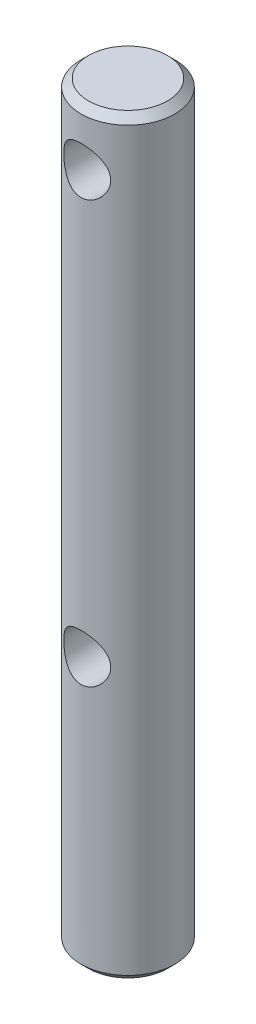
ISO-10303-21;
HEADER;
FILE_DESCRIPTION(('STEP AP214'),'2;1');
FILE_NAME('part.step','',(''),(''),'','','');
FILE_SCHEMA(('AUTOMOTIVE_DESIGN { 1 0 10303 214 1 1 1 1 }'));
ENDSEC;
DATA;
#1=APPLICATION_CONTEXT('core data for automotive mechanical design processes');
#2=APPLICATION_PROTOCOL_DEFINITION('international standard','automotive_design',2000,#1);
#3=PRODUCT_CONTEXT('',#1,'mechanical');
#4=PRODUCT('Part','Part','',(#3));
#5=PRODUCT_RELATED_PRODUCT_CATEGORY('part','',(#4));
#6=PRODUCT_DEFINITION_FORMATION('','',#4);
#7=PRODUCT_DEFINITION_CONTEXT('part definition',#1,'design');
#8=PRODUCT_DEFINITION('design','',#6,#7);
#9=PRODUCT_DEFINITION_SHAPE('','',#8);
#10=(LENGTH_UNIT() NAMED_UNIT(*) SI_UNIT(.MILLI.,.METRE.));
#11=(NAMED_UNIT(*) PLANE_ANGLE_UNIT() SI_UNIT($,.RADIAN.));
#12=(NAMED_UNIT(*) SI_UNIT($,.STERADIAN.) SOLID_ANGLE_UNIT());
#13=UNCERTAINTY_MEASURE_WITH_UNIT(LENGTH_MEASURE(1.E-05),#10,'distance_accuracy_value','');
#14=(GEOMETRIC_REPRESENTATION_CONTEXT(3) GLOBAL_UNCERTAINTY_ASSIGNED_CONTEXT((#13)) GLOBAL_UNIT_ASSIGNED_CONTEXT((#10,
#11,#12)) REPRESENTATION_CONTEXT('',''));
#15=CARTESIAN_POINT('',(0.,0.,0.));
#16=DIRECTION('',(0.,0.,1.));
#17=DIRECTION('',(1.,0.,0.));
#18=AXIS2_PLACEMENT_3D('',#15,#16,#17);
#19=CARTESIAN_POINT('',(0.,50.8,0.));
#20=DIRECTION('',(0.,-1.,0.));
#21=DIRECTION('',(0.,0.,-1.));
#22=AXIS2_PLACEMENT_3D('',#19,#20,#21);
#23=CYLINDRICAL_SURFACE('',#22,3.175);
#24=CARTESIAN_POINT('',(0.,48.5775,-3.175));
#25=CARTESIAN_POINT('',(-0.083457991185083,48.5774947575715,-3.17499545030503));
#26=CARTESIAN_POINT('',(-0.167015477019881,48.5708800089203,-3.17167404493863));
#27=CARTESIAN_POINT('',(-0.331660873489373,48.5447135524578,-3.15871472708987));
#28=CARTESIAN_POINT('',(-0.412743787657887,48.525137276116,-3.1490648192841));
#29=CARTESIAN_POINT('',(-0.569807002497712,48.4740048288211,-3.12445843552858));
#30=CARTESIAN_POINT('',(-0.645805799665895,48.4424952150063,-3.10952259694341));
#31=CARTESIAN_POINT('',(-0.791325279180476,48.3686316385831,-3.07571420218771));
#32=CARTESIAN_POINT('',(-0.860846471709219,48.3262785310049,-3.05684195643221));
#33=CARTESIAN_POINT('',(-0.996168660697032,48.2290163664421,-3.01555559984673));
#34=CARTESIAN_POINT('',(-1.06149014765635,48.1735027142071,-2.99299628614965));
#35=CARTESIAN_POINT('',(-1.18233736872633,48.0527971516953,-2.94735202766705));
#36=CARTESIAN_POINT('',(-1.23785563818199,47.9875979353112,-2.92426669731842));
#37=CARTESIAN_POINT('',(-1.34183755071482,47.8433076826316,-2.87812085025789));
#38=CARTESIAN_POINT('',(-1.38942022018823,47.7635314438759,-2.85520109315084));
#39=CARTESIAN_POINT('',(-1.47029206018898,47.5958418541219,-2.81441491301059));
#40=CARTESIAN_POINT('',(-1.50359144125905,47.5079343706526,-2.79654488326096));
#41=CARTESIAN_POINT('',(-1.55278525197438,47.3318441451427,-2.76951863922521));
#42=CARTESIAN_POINT('',(-1.5696022981152,47.243992932343,-2.75990481139145));
#43=CARTESIAN_POINT('',(-1.58817785187779,47.0662335950251,-2.74926250293288));
#44=CARTESIAN_POINT('',(-1.58995124029225,46.976327591367,-2.7482255383247));
#45=CARTESIAN_POINT('',(-1.57906606838602,46.8085709363994,-2.75448601783382));
#46=CARTESIAN_POINT('',(-1.5681079882647,46.7305643504334,-2.76080162313447));
#47=CARTESIAN_POINT('',(-1.53501701037788,46.5776914688703,-2.77933513114987));
#48=CARTESIAN_POINT('',(-1.51288055293752,46.5028261818278,-2.79155491395445));
#49=CARTESIAN_POINT('',(-1.45765802636278,46.356223752052,-2.82078868805227));
#50=CARTESIAN_POINT('',(-1.42432891904664,46.2846000919276,-2.83790772054098));
#51=CARTESIAN_POINT('',(-1.34785367917295,46.1476180605134,-2.87501654296729));
#52=CARTESIAN_POINT('',(-1.30470313705229,46.0822625222348,-2.89500762088553));
#53=CARTESIAN_POINT('',(-1.20342986217405,45.9509475112701,-2.93867138171466));
#54=CARTESIAN_POINT('',(-1.14410245266123,45.8859622131978,-2.96248947500834));
#55=CARTESIAN_POINT('',(-1.01529448125193,45.7664575229869,-3.00906851989396));
#56=CARTESIAN_POINT('',(-0.945809094811676,45.7119431326462,-3.03182896234596));
#57=CARTESIAN_POINT('',(-0.794569953008056,45.6125490131153,-3.07501904811705));
#58=CARTESIAN_POINT('',(-0.712396326664058,45.5682342499924,-3.09529137357187));
#59=CARTESIAN_POINT('',(-0.540490117088461,45.4944209663942,-3.12988136279972));
#60=CARTESIAN_POINT('',(-0.450763602321123,45.4649106812884,-3.14420375322891));
#61=CARTESIAN_POINT('',(-0.274266805511363,45.4239702965998,-3.16427379814529));
#62=CARTESIAN_POINT('',(-0.187867179745466,45.411245163252,-3.1706333955333));
#63=CARTESIAN_POINT('',(-0.013937614919594,45.400174739324,-3.17615908866327));
#64=CARTESIAN_POINT('',(0.0735917690434815,45.4018226365473,-3.17532859220093));
#65=CARTESIAN_POINT('',(0.240082343027755,45.4187031178648,-3.16692267702328));
#66=CARTESIAN_POINT('',(0.319181810279265,45.4328728957089,-3.15987502529967));
#67=CARTESIAN_POINT('',(0.473720941529333,45.4727279391335,-3.14042696962309));
#68=CARTESIAN_POINT('',(0.549160201034602,45.4984144742449,-3.12802597555879));
#69=CARTESIAN_POINT('',(0.696735665913698,45.5612475654624,-3.09854999119071));
#70=CARTESIAN_POINT('',(0.768715755246715,45.5987007920596,-3.08135149809289));
#71=CARTESIAN_POINT('',(0.905607411697596,45.6836582128389,-3.043935592289));
#72=CARTESIAN_POINT('',(0.970515949770341,45.7311666886702,-3.02371689462514));
#73=CARTESIAN_POINT('',(1.09818120674663,45.8402696752125,-2.97986801371214));
#74=CARTESIAN_POINT('',(1.16010067353771,45.9027893036567,-2.95609779689055));
#75=CARTESIAN_POINT('',(1.27294690977618,46.0373811776534,-2.90929046679002));
#76=CARTESIAN_POINT('',(1.3238660748176,46.1094599761711,-2.88625386997575));
#77=CARTESIAN_POINT('',(1.41558631423544,46.2655343009996,-2.84243767627802));
#78=CARTESIAN_POINT('',(1.45577797458289,46.349937884925,-2.82182140722634));
#79=CARTESIAN_POINT('',(1.52095648617134,46.5256722322753,-2.78723839766939));
#80=CARTESIAN_POINT('',(1.54596292893889,46.6169938982662,-2.77326309427028));
#81=CARTESIAN_POINT('',(1.57775542885366,46.7945949788295,-2.75528882878461));
#82=CARTESIAN_POINT('',(1.58606013179365,46.8805168773284,-2.75046096250791));
#83=CARTESIAN_POINT('',(1.58859403257222,47.0526222191237,-2.74900000493545));
#84=CARTESIAN_POINT('',(1.5828293315144,47.1388055328714,-2.75236336156894));
#85=CARTESIAN_POINT('',(1.55880772437938,47.3003300586843,-2.76602606006084));
#86=CARTESIAN_POINT('',(1.54179319901956,47.3759219963548,-2.7756341249122));
#87=CARTESIAN_POINT('',(1.49729088118125,47.5230953895862,-2.79988988197899));
#88=CARTESIAN_POINT('',(1.46979971971637,47.5946755465711,-2.81453919516849));
#89=CARTESIAN_POINT('',(1.40305749566464,47.7371169509411,-2.84842791953701));
#90=CARTESIAN_POINT('',(1.36314043128242,47.8076067941536,-2.86790959303524));
#91=CARTESIAN_POINT('',(1.27341466747435,47.9413483261878,-2.90886088970341));
#92=CARTESIAN_POINT('',(1.22360082184597,48.0045962222023,-2.93033154400532));
#93=CARTESIAN_POINT('',(1.10839778107492,48.130050396988,-2.97596438013471));
#94=CARTESIAN_POINT('',(1.04185152150814,48.1911963249811,-3.00013660999272));
#95=CARTESIAN_POINT('',(0.898770754895197,48.3016924862035,-3.0460593171264));
#96=CARTESIAN_POINT('',(0.822230898247,48.3510363614085,-3.06780848569085));
#97=CARTESIAN_POINT('',(0.660291409892928,48.4365877258054,-3.10670590186878));
#98=CARTESIAN_POINT('',(0.574832962245561,48.4726998686629,-3.12382053184118));
#99=CARTESIAN_POINT('',(0.398053085556713,48.5295704663149,-3.15120879312142));
#100=CARTESIAN_POINT('',(0.306749131847696,48.5503725568041,-3.1615018583887));
#101=CARTESIAN_POINT('',(0.178755590054295,48.5678121400986,-3.17016545787646));
#102=CARTESIAN_POINT('',(0.143131983613484,48.5714399423753,-3.17197367477648));
#103=CARTESIAN_POINT('',(0.0716783742405832,48.5762850315036,-3.17439193950695));
#104=CARTESIAN_POINT('',(0.0358483656390228,48.5775022518214,-3.17500195426617));
#105=CARTESIAN_POINT('',(0.,48.5775,-3.175));
#106=B_SPLINE_CURVE_WITH_KNOTS('',3,(#24,#25,#26,#27,#28,#29,#30,#31,#32,#33,#34,#35,#36,#37,
#38,#39,#40,#41,#42,#43,#44,#45,#46,#47,#48,#49,#50,#51,#52,#53,#54,#55,#56,#57,#58,#59,#60,#61,
#62,#63,#64,#65,#66,#67,#68,#69,#70,#71,#72,#73,#74,#75,#76,#77,#78,#79,#80,#81,#82,#83,#84,#85,
#86,#87,#88,#89,#90,#91,#92,#93,#94,#95,#96,#97,#98,#99,#100,#101,#102,#103,#104,#105),
.UNSPECIFIED.,.T.,.F.,(4,2,2,2,2,2,2,2,2,2,2,2,2,2,2,2,2,2,2,2,2,2,2,2,2,2,2,2,2,2,2,2,2,2,2,2,
2,2,2,2,4),(0.,0.250228508654714,0.500932687663352,0.750668671844023,1.00038496992324,
1.26520854196497,1.53023290227578,1.8158099070882,2.10118242288521,2.36947094272614,
2.63749404759819,2.87346568449796,3.10951251232015,3.35105756267474,3.59271127500602,
3.86500594367532,4.13743036175415,4.42250547765424,4.70735369348243,4.96860973623261,
5.22974196161968,5.47063464078468,5.71155388089103,5.95936158944289,6.20727503062988,
6.47953381898015,6.75198021926997,7.03762057931739,7.32289162713402,7.58077775661086,
7.83855207535177,8.07176964270058,8.30506226951507,8.55402875138706,8.80312503315514,
9.08248822877009,9.36200158617726,9.64349121690847,9.92417542436073,10.0316550721259,
10.1391376863632),.UNSPECIFIED.);
#107=CARTESIAN_POINT('',(0.,48.5775,-3.175));
#108=VERTEX_POINT('',#107);
#109=EDGE_CURVE('E40',#108,#108,#106,.T.);
#110=ORIENTED_EDGE('',*,*,#109,.T.);
#111=EDGE_LOOP('',(#110));
#112=FACE_BOUND('',#111,.T.);
#113=CARTESIAN_POINT('',(1.5875,46.99,2.74963065701559));
#114=CARTESIAN_POINT('',(1.58749422638082,46.90727885449,2.74963786381429));
#115=CARTESIAN_POINT('',(1.58099120353898,46.824453259204,2.75342034385563));
#116=CARTESIAN_POINT('',(1.55531059571316,46.661344217325,2.76800256742633));
#117=CARTESIAN_POINT('',(1.53610637747976,46.5810664848686,2.77881705563201));
#118=CARTESIAN_POINT('',(1.48605866856095,46.425720482854,2.8058958773607));
#119=CARTESIAN_POINT('',(1.4552770495838,46.3506269891982,2.82213119013788));
#120=CARTESIAN_POINT('',(1.38313719653499,46.2066890793302,2.85817730396762));
#121=CARTESIAN_POINT('',(1.34177839028179,46.1378450014584,2.87798829843252));
#122=CARTESIAN_POINT('',(1.24565813309277,46.002089655915,2.92095029628688));
#123=CARTESIAN_POINT('',(1.19007260737824,45.9358061221183,2.94424201025251));
#124=CARTESIAN_POINT('',(1.06879041958797,45.8130141834043,2.99040522672308));
#125=CARTESIAN_POINT('',(1.00308874467939,45.7565106543987,3.01327651457109));
#126=CARTESIAN_POINT('',(0.858027181920594,45.6511546475531,3.05786594662806));
#127=CARTESIAN_POINT('',(0.778045162557466,45.603074643523,3.07940243938849));
#128=CARTESIAN_POINT('',(0.609849279726715,45.5213388954723,3.11706825308002));
#129=CARTESIAN_POINT('',(0.521640654294323,45.4876740483822,3.1332009850419));
#130=CARTESIAN_POINT('',(0.346146348482491,45.4382113501845,3.15722732225227));
#131=CARTESIAN_POINT('',(0.259241592401001,45.4213126269106,3.16562549850666));
#132=CARTESIAN_POINT('',(0.0834558730578376,45.4022362866034,3.17512039355631));
#133=CARTESIAN_POINT('',(-0.0054238617769311,45.4000497623368,3.17622153020536));
#134=CARTESIAN_POINT('',(-0.1743591325227,45.4100353449279,3.17123733792365));
#135=CARTESIAN_POINT('',(-0.254509903693154,45.4209753496399,3.16576862228805));
#136=CARTESIAN_POINT('',(-0.411660612920334,45.4546983396986,3.14919114349849));
#137=CARTESIAN_POINT('',(-0.488660314736604,45.4774822112498,3.138081958304));
#138=CARTESIAN_POINT('',(-0.638666159116664,45.5343935736676,3.11104888469151));
#139=CARTESIAN_POINT('',(-0.711602309830344,45.5686736471607,3.09506050927604));
#140=CARTESIAN_POINT('',(-0.850863172402407,45.6473931732199,3.05971013003866));
#141=CARTESIAN_POINT('',(-0.917185505031348,45.6918362629925,3.04034691900006));
#142=CARTESIAN_POINT('',(-1.04802568667588,45.7944463705587,2.99790476108776));
#143=CARTESIAN_POINT('',(-1.1117803441091,45.8535135574675,2.97464759397103));
#144=CARTESIAN_POINT('',(-1.22889068784772,45.9812861883266,2.92821265681564));
#145=CARTESIAN_POINT('',(-1.28223837337409,46.0499989784851,2.90503496121686));
#146=CARTESIAN_POINT('',(-1.38033971874451,46.2004540054732,2.85978847796819));
#147=CARTESIAN_POINT('',(-1.42433248752765,46.2827465615986,2.83788357985248));
#148=CARTESIAN_POINT('',(-1.49751909188945,46.4549135532824,2.79996027317239));
#149=CARTESIAN_POINT('',(-1.52672836990979,46.5447799624154,2.78393572698132));
#150=CARTESIAN_POINT('',(-1.56714858500225,46.7220530366614,2.76137109359542));
#151=CARTESIAN_POINT('',(-1.57960238136546,46.8090902764816,2.75418003659488));
#152=CARTESIAN_POINT('',(-1.58990815274564,46.9842871296575,2.74824696986555));
#153=CARTESIAN_POINT('',(-1.5877704422376,47.0724459062277,2.74949899186782));
#154=CARTESIAN_POINT('',(-1.57009471880854,47.2371005957437,2.75962009258178));
#155=CARTESIAN_POINT('',(-1.55604815903104,47.3138173786338,2.76764095166814));
#156=CARTESIAN_POINT('',(-1.517167851854,47.4636588607051,2.78914259212754));
#157=CARTESIAN_POINT('',(-1.49233061106499,47.5367823880602,2.80262514157991));
#158=CARTESIAN_POINT('',(-1.43136554691026,47.681215487808,2.83426252551455));
#159=CARTESIAN_POINT('',(-1.3947680761122,47.752284189255,2.85260483648363));
#160=CARTESIAN_POINT('',(-1.31173071412509,47.8876824685682,2.89172839701884));
#161=CARTESIAN_POINT('',(-1.26528576687739,47.9520085590773,2.91251089701297));
#162=CARTESIAN_POINT('',(-1.15702900292818,48.0805787934436,2.95732197549433));
#163=CARTESIAN_POINT('',(-1.09401811980001,48.1437904767643,2.98142950757434));
#164=CARTESIAN_POINT('',(-0.957904636444784,48.2590669278148,3.02790598027404));
#165=CARTESIAN_POINT('',(-0.884798641015365,48.311127930241,3.05027433199738));
#166=CARTESIAN_POINT('',(-0.727924888062029,48.4037857899458,3.09151911684394));
#167=CARTESIAN_POINT('',(-0.643926667398906,48.4440438251598,3.11028781154346));
#168=CARTESIAN_POINT('',(-0.469141753867718,48.5094564223736,3.1413982599789));
#169=CARTESIAN_POINT('',(-0.37836110096008,48.534624246544,3.15374565586242));
#170=CARTESIAN_POINT('',(-0.201580245699537,48.5669725956273,3.16972169238739));
#171=CARTESIAN_POINT('',(-0.1159056671126,48.5755916279533,3.17404635554254));
#172=CARTESIAN_POINT('',(0.0557625026975351,48.5788386839089,3.17566881970521));
#173=CARTESIAN_POINT('',(0.141755971718449,48.5734716052811,3.17296908056188));
#174=CARTESIAN_POINT('',(0.30565406280347,48.5498514542119,3.16125175530202));
#175=CARTESIAN_POINT('',(0.383718304525382,48.5324708018034,3.15266220285434));
#176=CARTESIAN_POINT('',(0.535695449091493,48.4864933886065,3.13042448690684));
#177=CARTESIAN_POINT('',(0.609607754866869,48.4578950193516,3.11677559798313));
#178=CARTESIAN_POINT('',(0.754734657413753,48.3890208046865,3.08492415062641));
#179=CARTESIAN_POINT('',(0.825698664036324,48.3482978244075,3.06655179803093));
#180=CARTESIAN_POINT('',(0.960079743879765,48.2568917847613,3.02717411362649));
#181=CARTESIAN_POINT('',(1.02349332927116,48.2062041507789,3.00616757411397));
#182=CARTESIAN_POINT('',(1.14762598159906,48.0904595418015,2.96114168734771));
#183=CARTESIAN_POINT('',(1.20744882420609,48.0244745511299,2.93703055931071));
#184=CARTESIAN_POINT('',(1.31550296873904,47.8830469802065,2.89025133408528));
#185=CARTESIAN_POINT('',(1.36372401564097,47.8075961218726,2.86758452646961));
#186=CARTESIAN_POINT('',(1.44848433915973,47.6462143235527,2.82574373421554));
#187=CARTESIAN_POINT('',(1.48460629221299,47.5600275443331,2.80670276631829));
#188=CARTESIAN_POINT('',(1.54126995134143,47.3815848081106,2.77600023171258));
#189=CARTESIAN_POINT('',(1.56186376599086,47.2893502888511,2.76431400634477));
#190=CARTESIAN_POINT('',(1.57855762498476,47.1617589979024,2.75477720255342));
#191=CARTESIAN_POINT('',(1.58190581663011,47.1275284676434,2.75285404795678));
#192=CARTESIAN_POINT('',(1.58637828058031,47.0588713369169,2.75027923221803));
#193=CARTESIAN_POINT('',(1.58750240410979,47.0244447234874,2.74962765613611));
#194=CARTESIAN_POINT('',(1.5875,46.99,2.74963065701559));
#195=B_SPLINE_CURVE_WITH_KNOTS('',3,(#113,#114,#115,#116,#117,#118,#119,#120,#121,#122,#123,
#124,#125,#126,#127,#128,#129,#130,#131,#132,#133,#134,#135,#136,#137,#138,#139,#140,#141,#142,
#143,#144,#145,#146,#147,#148,#149,#150,#151,#152,#153,#154,#155,#156,#157,#158,#159,#160,#161,
#162,#163,#164,#165,#166,#167,#168,#169,#170,#171,#172,#173,#174,#175,#176,#177,#178,#179,#180,
#181,#182,#183,#184,#185,#186,#187,#188,#189,#190,#191,#192,#193,#194),.UNSPECIFIED.,.T.,.F.,(4,
2,2,2,2,2,2,2,2,2,2,2,2,2,2,2,2,2,2,2,2,2,2,2,2,2,2,2,2,2,2,2,2,2,2,2,2,2,2,2,4),(0.,
0.248018494619114,0.496558717359377,0.743789146021224,0.991032951644172,1.25866892109094,
1.52643794096438,1.81225653929037,2.09789437805177,2.36320782386597,2.62836062601588,
2.87045554756704,3.1125685862146,3.35803136385695,3.60358212718556,3.87234416437813,
4.14131201590395,4.42736036245499,4.71310929061081,4.97621386731062,5.23913247936542,
5.4732901618564,5.70752370742249,5.95260583044664,6.19781409374325,6.47393205434223,
6.75014310652895,7.03364387993082,7.31689512946424,7.5741572924331,7.83132937785429,
8.07155524483494,8.3118155695032,8.56235191767161,8.81300355284891,9.08860008936981,
9.36443934266681,9.64899564098785,9.93259273641882,10.0358596460668,10.1391334633508),.UNSPECIFIED.);
#196=CARTESIAN_POINT('',(1.5875,46.99,2.74963065701559));
#197=VERTEX_POINT('',#196);
#198=EDGE_CURVE('E99',#197,#197,#195,.T.);
#199=ORIENTED_EDGE('',*,*,#198,.T.);
#200=EDGE_LOOP('',(#199));
#201=FACE_BOUND('',#200,.T.);
#202=CARTESIAN_POINT('',(0.,20.066,-3.175));
#203=CARTESIAN_POINT('',(-0.0834579911850833,20.0659947575714,-3.17499545030503));
#204=CARTESIAN_POINT('',(-0.167015477019881,20.0593800089203,-3.17167404493863));
#205=CARTESIAN_POINT('',(-0.331660873489373,20.0332135524578,-3.15871472708987));
#206=CARTESIAN_POINT('',(-0.412743787657887,20.013637276116,-3.1490648192841));
#207=CARTESIAN_POINT('',(-0.569807002497711,19.9625048288211,-3.12445843552858));
#208=CARTESIAN_POINT('',(-0.645805799665893,19.9309952150063,-3.10952259694341));
#209=CARTESIAN_POINT('',(-0.791325279180473,19.8571316385831,-3.07571420218771));
#210=CARTESIAN_POINT('',(-0.860846471709217,19.8147785310049,-3.05684195643221));
#211=CARTESIAN_POINT('',(-0.99616866069703,19.7175163664421,-3.01555559984673));
#212=CARTESIAN_POINT('',(-1.06149014765635,19.6620027142071,-2.99299628614965));
#213=CARTESIAN_POINT('',(-1.18233736872633,19.5412971516953,-2.94735202766705));
#214=CARTESIAN_POINT('',(-1.23785563818199,19.4760979353112,-2.92426669731842));
#215=CARTESIAN_POINT('',(-1.34183755071482,19.3318076826316,-2.87812085025789));
#216=CARTESIAN_POINT('',(-1.38942022018822,19.2520314438759,-2.85520109315084));
#217=CARTESIAN_POINT('',(-1.47029206018898,19.0843418541219,-2.81441491301059));
#218=CARTESIAN_POINT('',(-1.50359144125905,18.9964343706526,-2.79654488326096));
#219=CARTESIAN_POINT('',(-1.55278525197438,18.8203441451427,-2.76951863922521));
#220=CARTESIAN_POINT('',(-1.5696022981152,18.732492932343,-2.75990481139145));
#221=CARTESIAN_POINT('',(-1.58817785187779,18.5547335950251,-2.74926250293288));
#222=CARTESIAN_POINT('',(-1.58995124029225,18.464827591367,-2.7482255383247));
#223=CARTESIAN_POINT('',(-1.57906606838602,18.2970709363994,-2.75448601783382));
#224=CARTESIAN_POINT('',(-1.5681079882647,18.2190643504334,-2.76080162313447));
#225=CARTESIAN_POINT('',(-1.53501701037788,18.0661914688703,-2.77933513114987));
#226=CARTESIAN_POINT('',(-1.51288055293752,17.9913261818278,-2.79155491395445));
#227=CARTESIAN_POINT('',(-1.45765802636278,17.844723752052,-2.82078868805226));
#228=CARTESIAN_POINT('',(-1.42432891904664,17.7731000919276,-2.83790772054098));
#229=CARTESIAN_POINT('',(-1.34785367917295,17.6361180605134,-2.87501654296728));
#230=CARTESIAN_POINT('',(-1.30470313705229,17.5707625222349,-2.89500762088552));
#231=CARTESIAN_POINT('',(-1.20342986217405,17.4394475112701,-2.93867138171466));
#232=CARTESIAN_POINT('',(-1.14410245266124,17.3744622131978,-2.96248947500834));
#233=CARTESIAN_POINT('',(-1.01529448125193,17.2549575229869,-3.00906851989396));
#234=CARTESIAN_POINT('',(-0.945809094811678,17.2004431326462,-3.03182896234596));
#235=CARTESIAN_POINT('',(-0.79456995300806,17.1010490131153,-3.07501904811705));
#236=CARTESIAN_POINT('',(-0.712396326664062,17.0567342499924,-3.09529137357186));
#237=CARTESIAN_POINT('',(-0.540490117088466,16.9829209663942,-3.12988136279972));
#238=CARTESIAN_POINT('',(-0.450763602321126,16.9534106812884,-3.14420375322891));
#239=CARTESIAN_POINT('',(-0.274266805511365,16.9124702965998,-3.16427379814529));
#240=CARTESIAN_POINT('',(-0.187867179745468,16.899745163252,-3.1706333955333));
#241=CARTESIAN_POINT('',(-0.0139376149195961,16.888674739324,-3.17615908866327));
#242=CARTESIAN_POINT('',(0.0735917690434799,16.8903226365473,-3.17532859220093));
#243=CARTESIAN_POINT('',(0.240082343027754,16.9072031178648,-3.16692267702328));
#244=CARTESIAN_POINT('',(0.319181810279264,16.9213728957089,-3.15987502529967));
#245=CARTESIAN_POINT('',(0.473720941529331,16.9612279391335,-3.14042696962309));
#246=CARTESIAN_POINT('',(0.5491602010346,16.9869144742449,-3.12802597555879));
#247=CARTESIAN_POINT('',(0.696735665913696,17.0497475654624,-3.09854999119071));
#248=CARTESIAN_POINT('',(0.768715755246711,17.0872007920596,-3.08135149809289));
#249=CARTESIAN_POINT('',(0.905607411697592,17.1721582128389,-3.043935592289));
#250=CARTESIAN_POINT('',(0.970515949770337,17.2196666886702,-3.02371689462515));
#251=CARTESIAN_POINT('',(1.09818120674663,17.3287696752125,-2.97986801371214));
#252=CARTESIAN_POINT('',(1.1601006735377,17.3912893036567,-2.95609779689055));
#253=CARTESIAN_POINT('',(1.27294690977618,17.5258811776534,-2.90929046679002));
#254=CARTESIAN_POINT('',(1.3238660748176,17.5979599761711,-2.88625386997575));
#255=CARTESIAN_POINT('',(1.41558631423544,17.7540343009996,-2.84243767627802));
#256=CARTESIAN_POINT('',(1.45577797458289,17.838437884925,-2.82182140722634));
#257=CARTESIAN_POINT('',(1.52095648617134,18.0141722322753,-2.78723839766939));
#258=CARTESIAN_POINT('',(1.54596292893889,18.1054938982662,-2.77326309427028));
#259=CARTESIAN_POINT('',(1.57775542885366,18.2830949788295,-2.75528882878461));
#260=CARTESIAN_POINT('',(1.58606013179365,18.3690168773284,-2.75046096250791));
#261=CARTESIAN_POINT('',(1.58859403257222,18.5411222191237,-2.74900000493545));
#262=CARTESIAN_POINT('',(1.5828293315144,18.6273055328714,-2.75236336156894));
#263=CARTESIAN_POINT('',(1.55880772437938,18.7888300586843,-2.76602606006084));
#264=CARTESIAN_POINT('',(1.54179319901956,18.8644219963548,-2.7756341249122));
#265=CARTESIAN_POINT('',(1.49729088118125,19.0115953895862,-2.79988988197899));
#266=CARTESIAN_POINT('',(1.46979971971638,19.0831755465711,-2.81453919516849));
#267=CARTESIAN_POINT('',(1.40305749566465,19.2256169509411,-2.848427919537));
#268=CARTESIAN_POINT('',(1.36314043128242,19.2961067941536,-2.86790959303524));
#269=CARTESIAN_POINT('',(1.27341466747436,19.4298483261877,-2.90886088970341));
#270=CARTESIAN_POINT('',(1.22360082184598,19.4930962222023,-2.93033154400532));
#271=CARTESIAN_POINT('',(1.10839778107493,19.618550396988,-2.97596438013471));
#272=CARTESIAN_POINT('',(1.04185152150815,19.6796963249811,-3.00013660999272));
#273=CARTESIAN_POINT('',(0.898770754895199,19.7901924862035,-3.0460593171264));
#274=CARTESIAN_POINT('',(0.822230898247,19.8395363614085,-3.06780848569085));
#275=CARTESIAN_POINT('',(0.660291409892926,19.9250877258054,-3.10670590186878));
#276=CARTESIAN_POINT('',(0.574832962245559,19.9611998686629,-3.12382053184118));
#277=CARTESIAN_POINT('',(0.398053085556712,20.0180704663149,-3.15120879312142));
#278=CARTESIAN_POINT('',(0.306749131847696,20.0388725568041,-3.1615018583887));
#279=CARTESIAN_POINT('',(0.178755590054296,20.0563121400986,-3.17016545787646));
#280=CARTESIAN_POINT('',(0.143131983613485,20.0599399423753,-3.17197367477648));
#281=CARTESIAN_POINT('',(0.0716783742405836,20.0647850315036,-3.17439193950695));
#282=CARTESIAN_POINT('',(0.035848365639023,20.0660022518215,-3.17500195426617));
#283=CARTESIAN_POINT('',(0.,20.066,-3.175));
#284=B_SPLINE_CURVE_WITH_KNOTS('',3,(#202,#203,#204,#205,#206,#207,#208,#209,#210,#211,#212,
#213,#214,#215,#216,#217,#218,#219,#220,#221,#222,#223,#224,#225,#226,#227,#228,#229,#230,#231,
#232,#233,#234,#235,#236,#237,#238,#239,#240,#241,#242,#243,#244,#245,#246,#247,#248,#249,#250,
#251,#252,#253,#254,#255,#256,#257,#258,#259,#260,#261,#262,#263,#264,#265,#266,#267,#268,#269,
#270,#271,#272,#273,#274,#275,#276,#277,#278,#279,#280,#281,#282,#283),.UNSPECIFIED.,.T.,.F.,(4,
2,2,2,2,2,2,2,2,2,2,2,2,2,2,2,2,2,2,2,2,2,2,2,2,2,2,2,2,2,2,2,2,2,2,2,2,2,2,2,4),(0.,
0.250228508654715,0.50093268766335,0.750668671844021,1.00038496992324,1.26520854196497,
1.53023290227578,1.8158099070882,2.10118242288521,2.36947094272614,2.63749404759819,
2.87346568449796,3.10951251232014,3.35105756267473,3.59271127500602,3.86500594367532,
4.13743036175414,4.42250547765424,4.70735369348243,4.96860973623261,5.22974196161968,
5.47063464078468,5.71155388089103,5.95936158944288,6.20727503062988,6.47953381898014,
6.75198021926997,7.03762057931739,7.32289162713403,7.58077775661086,7.83855207535176,
8.07176964270058,8.30506226951507,8.55402875138705,8.80312503315513,9.08248822877009,
9.36200158617727,9.64349121690848,9.92417542436074,10.0316550721259,10.1391376863632),.UNSPECIFIED.);
#285=CARTESIAN_POINT('',(0.,20.066,-3.175));
#286=VERTEX_POINT('',#285);
#287=EDGE_CURVE('E65',#286,#286,#284,.T.);
#288=ORIENTED_EDGE('',*,*,#287,.T.);
#289=EDGE_LOOP('',(#288));
#290=FACE_BOUND('',#289,.T.);
#291=CARTESIAN_POINT('',(1.5875,18.4785,2.74963065701559));
#292=CARTESIAN_POINT('',(1.58749422638082,18.39577885449,2.74963786381429));
#293=CARTESIAN_POINT('',(1.58099120353898,18.312953259204,2.75342034385563));
#294=CARTESIAN_POINT('',(1.55531059571316,18.149844217325,2.76800256742633));
#295=CARTESIAN_POINT('',(1.53610637747976,18.0695664848686,2.77881705563201));
#296=CARTESIAN_POINT('',(1.48605866856095,17.914220482854,2.8058958773607));
#297=CARTESIAN_POINT('',(1.4552770495838,17.8391269891982,2.82213119013788));
#298=CARTESIAN_POINT('',(1.38313719653499,17.6951890793302,2.85817730396762));
#299=CARTESIAN_POINT('',(1.34177839028179,17.6263450014584,2.87798829843253));
#300=CARTESIAN_POINT('',(1.24565813309277,17.490589655915,2.92095029628688));
#301=CARTESIAN_POINT('',(1.19007260737824,17.4243061221182,2.94424201025251));
#302=CARTESIAN_POINT('',(1.06879041958797,17.3015141834043,2.99040522672308));
#303=CARTESIAN_POINT('',(1.00308874467939,17.2450106543987,3.01327651457109));
#304=CARTESIAN_POINT('',(0.858027181920591,17.1396546475531,3.05786594662807));
#305=CARTESIAN_POINT('',(0.778045162557461,17.091574643523,3.07940243938849));
#306=CARTESIAN_POINT('',(0.609849279726712,17.0098388954724,3.11706825308002));
#307=CARTESIAN_POINT('',(0.521640654294321,16.9761740483822,3.1332009850419));
#308=CARTESIAN_POINT('',(0.346146348482488,16.9267113501845,3.15722732225227));
#309=CARTESIAN_POINT('',(0.259241592400997,16.9098126269106,3.16562549850666));
#310=CARTESIAN_POINT('',(0.0834558730578336,16.8907362866034,3.17512039355631));
#311=CARTESIAN_POINT('',(-0.00542386177693499,16.8885497623368,3.17622153020536));
#312=CARTESIAN_POINT('',(-0.174359132522703,16.8985353449279,3.17123733792365));
#313=CARTESIAN_POINT('',(-0.254509903693156,16.9094753496399,3.16576862228805));
#314=CARTESIAN_POINT('',(-0.411660612920336,16.9431983396986,3.14919114349849));
#315=CARTESIAN_POINT('',(-0.488660314736606,16.9659822112498,3.138081958304));
#316=CARTESIAN_POINT('',(-0.638666159116666,17.0228935736676,3.11104888469151));
#317=CARTESIAN_POINT('',(-0.711602309830346,17.0571736471607,3.09506050927604));
#318=CARTESIAN_POINT('',(-0.850863172402409,17.1358931732199,3.05971013003866));
#319=CARTESIAN_POINT('',(-0.91718550503135,17.1803362629925,3.04034691900006));
#320=CARTESIAN_POINT('',(-1.04802568667588,17.2829463705587,2.99790476108776));
#321=CARTESIAN_POINT('',(-1.11178034410911,17.3420135574675,2.97464759397103));
#322=CARTESIAN_POINT('',(-1.22889068784773,17.4697861883267,2.92821265681563));
#323=CARTESIAN_POINT('',(-1.28223837337409,17.5384989784851,2.90503496121686));
#324=CARTESIAN_POINT('',(-1.38033971874451,17.6889540054732,2.85978847796819));
#325=CARTESIAN_POINT('',(-1.42433248752766,17.7712465615986,2.83788357985248));
#326=CARTESIAN_POINT('',(-1.49751909188945,17.9434135532824,2.79996027317239));
#327=CARTESIAN_POINT('',(-1.52672836990979,18.0332799624154,2.78393572698132));
#328=CARTESIAN_POINT('',(-1.56714858500225,18.2105530366614,2.76137109359542));
#329=CARTESIAN_POINT('',(-1.57960238136546,18.2975902764816,2.75418003659488));
#330=CARTESIAN_POINT('',(-1.58990815274564,18.4727871296575,2.74824696986555));
#331=CARTESIAN_POINT('',(-1.5877704422376,18.5609459062277,2.74949899186782));
#332=CARTESIAN_POINT('',(-1.57009471880855,18.7256005957437,2.75962009258178));
#333=CARTESIAN_POINT('',(-1.55604815903104,18.8023173786338,2.76764095166813));
#334=CARTESIAN_POINT('',(-1.517167851854,18.9521588607051,2.78914259212754));
#335=CARTESIAN_POINT('',(-1.49233061106499,19.0252823880602,2.80262514157991));
#336=CARTESIAN_POINT('',(-1.43136554691026,19.169715487808,2.83426252551455));
#337=CARTESIAN_POINT('',(-1.3947680761122,19.240784189255,2.85260483648363));
#338=CARTESIAN_POINT('',(-1.31173071412509,19.3761824685681,2.89172839701884));
#339=CARTESIAN_POINT('',(-1.26528576687739,19.4405085590773,2.91251089701297));
#340=CARTESIAN_POINT('',(-1.15702900292818,19.5690787934436,2.95732197549433));
#341=CARTESIAN_POINT('',(-1.09401811980001,19.6322904767643,2.98142950757434));
#342=CARTESIAN_POINT('',(-0.957904636444783,19.7475669278148,3.02790598027404));
#343=CARTESIAN_POINT('',(-0.884798641015363,19.799627930241,3.05027433199738));
#344=CARTESIAN_POINT('',(-0.727924888062027,19.8922857899458,3.09151911684394));
#345=CARTESIAN_POINT('',(-0.643926667398905,19.9325438251598,3.11028781154346));
#346=CARTESIAN_POINT('',(-0.469141753867718,19.9979564223736,3.1413982599789));
#347=CARTESIAN_POINT('',(-0.378361100960079,20.023124246544,3.15374565586242));
#348=CARTESIAN_POINT('',(-0.201580245699536,20.0554725956273,3.16972169238739));
#349=CARTESIAN_POINT('',(-0.1159056671126,20.0640916279533,3.17404635554254));
#350=CARTESIAN_POINT('',(0.0557625026975361,20.0673386839089,3.17566881970521));
#351=CARTESIAN_POINT('',(0.141755971718451,20.0619716052812,3.17296908056188));
#352=CARTESIAN_POINT('',(0.305654062803471,20.0383514542119,3.16125175530202));
#353=CARTESIAN_POINT('',(0.38371830452538,20.0209708018034,3.15266220285434));
#354=CARTESIAN_POINT('',(0.535695449091492,19.9749933886065,3.13042448690684));
#355=CARTESIAN_POINT('',(0.60960775486687,19.9463950193516,3.11677559798313));
#356=CARTESIAN_POINT('',(0.754734657413754,19.8775208046865,3.08492415062641));
#357=CARTESIAN_POINT('',(0.825698664036323,19.8367978244076,3.06655179803093));
#358=CARTESIAN_POINT('',(0.960079743879764,19.7453917847613,3.02717411362649));
#359=CARTESIAN_POINT('',(1.02349332927117,19.6947041507789,3.00616757411397));
#360=CARTESIAN_POINT('',(1.14762598159906,19.5789595418015,2.96114168734771));
#361=CARTESIAN_POINT('',(1.20744882420609,19.51297455113,2.9370305593107));
#362=CARTESIAN_POINT('',(1.31550296873905,19.3715469802065,2.89025133408528));
#363=CARTESIAN_POINT('',(1.36372401564097,19.2960961218725,2.86758452646961));
#364=CARTESIAN_POINT('',(1.44848433915972,19.1347143235527,2.82574373421554));
#365=CARTESIAN_POINT('',(1.48460629221299,19.0485275443331,2.80670276631829));
#366=CARTESIAN_POINT('',(1.54126995134143,18.8700848081106,2.77600023171258));
#367=CARTESIAN_POINT('',(1.56186376599086,18.7778502888511,2.76431400634477));
#368=CARTESIAN_POINT('',(1.57855762498476,18.6502589979025,2.75477720255342));
#369=CARTESIAN_POINT('',(1.58190581663011,18.6160284676434,2.75285404795678));
#370=CARTESIAN_POINT('',(1.58637828058032,18.5473713369169,2.75027923221803));
#371=CARTESIAN_POINT('',(1.58750240410979,18.5129447234874,2.74962765613611));
#372=CARTESIAN_POINT('',(1.5875,18.4785,2.74963065701559));
#373=B_SPLINE_CURVE_WITH_KNOTS('',3,(#291,#292,#293,#294,#295,#296,#297,#298,#299,#300,#301,
#302,#303,#304,#305,#306,#307,#308,#309,#310,#311,#312,#313,#314,#315,#316,#317,#318,#319,#320,
#321,#322,#323,#324,#325,#326,#327,#328,#329,#330,#331,#332,#333,#334,#335,#336,#337,#338,#339,
#340,#341,#342,#343,#344,#345,#346,#347,#348,#349,#350,#351,#352,#353,#354,#355,#356,#357,#358,
#359,#360,#361,#362,#363,#364,#365,#366,#367,#368,#369,#370,#371,#372),.UNSPECIFIED.,.T.,.F.,(4,
2,2,2,2,2,2,2,2,2,2,2,2,2,2,2,2,2,2,2,2,2,2,2,2,2,2,2,2,2,2,2,2,2,2,2,2,2,2,2,4),(0.,
0.24801849461911,0.496558717359377,0.743789146021232,0.991032951644174,1.25866892109094,
1.52643794096439,1.81225653929037,2.09789437805177,2.36320782386597,2.62836062601588,
2.87045554756704,3.1125685862146,3.35803136385695,3.60358212718556,3.87234416437814,
4.14131201590396,4.42736036245499,4.71310929061081,4.97621386731061,5.23913247936542,
5.4732901618564,5.7075237074225,5.95260583044664,6.19781409374325,6.47393205434223,
6.75014310652895,7.03364387993083,7.31689512946424,7.5741572924331,7.83132937785429,
8.07155524483494,8.3118155695032,8.56235191767161,8.81300355284891,9.08860008936981,
9.36443934266682,9.64899564098784,9.93259273641881,10.0358596460668,10.1391334633508),.UNSPECIFIED.);
#374=CARTESIAN_POINT('',(1.5875,18.4785,2.74963065701559));
#375=VERTEX_POINT('',#374);
#376=EDGE_CURVE('E58',#375,#375,#373,.T.);
#377=ORIENTED_EDGE('',*,*,#376,.T.);
#378=EDGE_LOOP('',(#377));
#379=FACE_BOUND('',#378,.T.);
#380=CARTESIAN_POINT('',(0.,0.508000000000015,0.));
#381=DIRECTION('',(0.,1.,0.));
#382=DIRECTION('',(0.,0.,1.));
#383=AXIS2_PLACEMENT_3D('',#380,#381,#382);
#384=CIRCLE('',#383,3.175);
#385=CARTESIAN_POINT('',(0.,0.508000000000015,3.175));
#386=VERTEX_POINT('',#385);
#387=EDGE_CURVE('E54',#386,#386,#384,.T.);
#388=ORIENTED_EDGE('',*,*,#387,.T.);
#389=EDGE_LOOP('',(#388));
#390=FACE_BOUND('',#389,.T.);
#391=CARTESIAN_POINT('',(0.,50.292,0.));
#392=DIRECTION('',(0.,1.,0.));
#393=DIRECTION('',(0.,0.,1.));
#394=AXIS2_PLACEMENT_3D('',#391,#392,#393);
#395=CIRCLE('',#394,3.175);
#396=CARTESIAN_POINT('',(0.,50.292,3.175));
#397=VERTEX_POINT('',#396);
#398=EDGE_CURVE('E110',#397,#397,#395,.F.);
#399=ORIENTED_EDGE('',*,*,#398,.T.);
#400=EDGE_LOOP('',(#399));
#401=FACE_BOUND('',#400,.T.);
#402=ADVANCED_FACE('F35',(#112,#201,#290,#379,#390,#401),#23,.T.);
#403=CARTESIAN_POINT('',(0.,50.8,0.));
#404=DIRECTION('',(0.,1.,0.));
#405=DIRECTION('',(0.,0.,1.));
#406=AXIS2_PLACEMENT_3D('',#403,#404,#405);
#407=PLANE('',#406);
#408=CARTESIAN_POINT('',(0.,50.8,0.));
#409=DIRECTION('',(0.,1.,0.));
#410=DIRECTION('',(0.,0.,1.));
#411=AXIS2_PLACEMENT_3D('',#408,#409,#410);
#412=CIRCLE('',#411,2.667);
#413=CARTESIAN_POINT('',(0.,50.8,2.667));
#414=VERTEX_POINT('',#413);
#415=EDGE_CURVE('E10',#414,#414,#412,.T.);
#416=ORIENTED_EDGE('',*,*,#415,.T.);
#417=EDGE_LOOP('',(#416));
#418=FACE_BOUND('',#417,.T.);
#419=ADVANCED_FACE('F78',(#418),#407,.T.);
#420=CARTESIAN_POINT('',(0.,0.,0.));
#421=DIRECTION('',(0.,1.,0.));
#422=DIRECTION('',(0.,0.,1.));
#423=AXIS2_PLACEMENT_3D('',#420,#421,#422);
#424=PLANE('',#423);
#425=CARTESIAN_POINT('',(0.,0.,0.));
#426=DIRECTION('',(0.,1.,0.));
#427=DIRECTION('',(0.,0.,1.));
#428=AXIS2_PLACEMENT_3D('',#425,#426,#427);
#429=CIRCLE('',#428,2.66699999999998);
#430=CARTESIAN_POINT('',(0.,0.,2.66699999999998));
#431=VERTEX_POINT('',#430);
#432=EDGE_CURVE('E49',#431,#431,#429,.F.);
#433=ORIENTED_EDGE('',*,*,#432,.T.);
#434=EDGE_LOOP('',(#433));
#435=FACE_BOUND('',#434,.T.);
#436=ADVANCED_FACE('F81',(#435),#424,.F.);
#437=CARTESIAN_POINT('',(0.,0.508000000000015,0.));
#438=DIRECTION('',(0.,1.,0.));
#439=DIRECTION('',(0.,0.,1.));
#440=AXIS2_PLACEMENT_3D('',#437,#438,#439);
#441=CONICAL_SURFACE('',#440,3.175,0.78539816339745);
#442=ORIENTED_EDGE('',*,*,#432,.F.);
#443=EDGE_LOOP('',(#442));
#444=FACE_BOUND('',#443,.T.);
#445=ORIENTED_EDGE('',*,*,#387,.F.);
#446=EDGE_LOOP('',(#445));
#447=FACE_BOUND('',#446,.T.);
#448=ADVANCED_FACE('F83',(#444,#447),#441,.T.);
#449=CARTESIAN_POINT('',(0.,50.8,0.));
#450=DIRECTION('',(0.,-1.,0.));
#451=DIRECTION('',(0.,0.,-1.));
#452=AXIS2_PLACEMENT_3D('',#449,#450,#451);
#453=CONICAL_SURFACE('',#452,2.667,0.785398163397451);
#454=ORIENTED_EDGE('',*,*,#398,.F.);
#455=EDGE_LOOP('',(#454));
#456=FACE_BOUND('',#455,.T.);
#457=ORIENTED_EDGE('',*,*,#415,.F.);
#458=EDGE_LOOP('',(#457));
#459=FACE_BOUND('',#458,.T.);
#460=ADVANCED_FACE('F38',(#456,#459),#453,.T.);
#461=CARTESIAN_POINT('',(0.,18.4785,-50.8));
#462=DIRECTION('',(0.,0.,1.));
#463=DIRECTION('',(1.,0.,0.));
#464=AXIS2_PLACEMENT_3D('',#461,#462,#463);
#465=CYLINDRICAL_SURFACE('',#464,1.5875);
#466=ORIENTED_EDGE('',*,*,#376,.F.);
#467=EDGE_LOOP('',(#466));
#468=FACE_BOUND('',#467,.T.);
#469=ORIENTED_EDGE('',*,*,#287,.F.);
#470=EDGE_LOOP('',(#469));
#471=FACE_BOUND('',#470,.T.);
#472=ADVANCED_FACE('F71',(#468,#471),#465,.F.);
#473=CARTESIAN_POINT('',(0.,46.99,-50.8));
#474=DIRECTION('',(0.,0.,1.));
#475=DIRECTION('',(1.,0.,0.));
#476=AXIS2_PLACEMENT_3D('',#473,#474,#475);
#477=CYLINDRICAL_SURFACE('',#476,1.5875);
#478=ORIENTED_EDGE('',*,*,#198,.F.);
#479=EDGE_LOOP('',(#478));
#480=FACE_BOUND('',#479,.T.);
#481=ORIENTED_EDGE('',*,*,#109,.F.);
#482=EDGE_LOOP('',(#481));
#483=FACE_BOUND('',#482,.T.);
#484=ADVANCED_FACE('F75',(#480,#483),#477,.F.);
#485=CLOSED_SHELL('',(#402,#419,#436,#448,#460,#472,#484));
#486=MANIFOLD_SOLID_BREP('B2',#485);
#487=ADVANCED_BREP_SHAPE_REPRESENTATION('',(#18,#486),#14);
#488=SHAPE_DEFINITION_REPRESENTATION(#9,#487);
ENDSEC;
END-ISO-10303-21;
